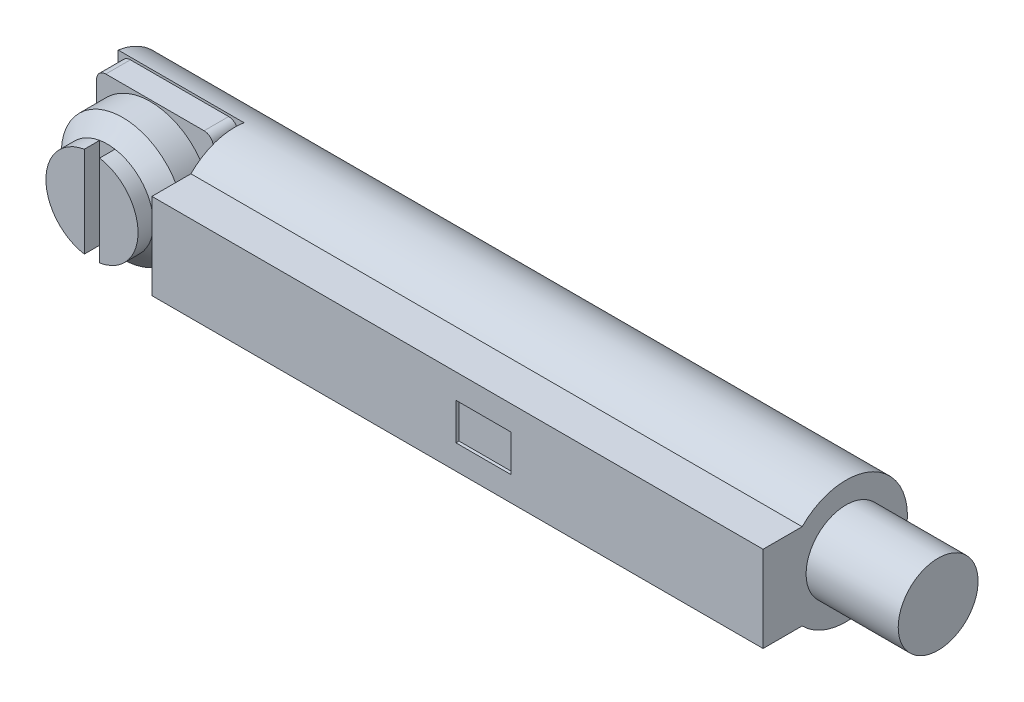
ISO-10303-21;
HEADER;
FILE_DESCRIPTION(('STEP AP214'),'2;1');
FILE_NAME('part.step','',(''),(''),'','','');
FILE_SCHEMA(('AUTOMOTIVE_DESIGN { 1 0 10303 214 1 1 1 1 }'));
ENDSEC;
DATA;
#1=APPLICATION_CONTEXT('core data for automotive mechanical design processes');
#2=APPLICATION_PROTOCOL_DEFINITION('international standard','automotive_design',2000,#1);
#3=PRODUCT_CONTEXT('',#1,'mechanical');
#4=PRODUCT('Part','Part','',(#3));
#5=PRODUCT_RELATED_PRODUCT_CATEGORY('part','',(#4));
#6=PRODUCT_DEFINITION_FORMATION('','',#4);
#7=PRODUCT_DEFINITION_CONTEXT('part definition',#1,'design');
#8=PRODUCT_DEFINITION('design','',#6,#7);
#9=PRODUCT_DEFINITION_SHAPE('','',#8);
#10=(LENGTH_UNIT() NAMED_UNIT(*) SI_UNIT(.MILLI.,.METRE.));
#11=(NAMED_UNIT(*) PLANE_ANGLE_UNIT() SI_UNIT($,.RADIAN.));
#12=(NAMED_UNIT(*) SI_UNIT($,.STERADIAN.) SOLID_ANGLE_UNIT());
#13=UNCERTAINTY_MEASURE_WITH_UNIT(LENGTH_MEASURE(1.E-05),#10,'distance_accuracy_value','');
#14=(GEOMETRIC_REPRESENTATION_CONTEXT(3) GLOBAL_UNCERTAINTY_ASSIGNED_CONTEXT((#13)) GLOBAL_UNIT_ASSIGNED_CONTEXT((#10,
#11,#12)) REPRESENTATION_CONTEXT('',''));
#15=CARTESIAN_POINT('',(0.,0.,0.));
#16=DIRECTION('',(0.,0.,1.));
#17=DIRECTION('',(1.,0.,0.));
#18=AXIS2_PLACEMENT_3D('',#15,#16,#17);
#19=CARTESIAN_POINT('',(24.,2.,0.));
#20=DIRECTION('',(1.,0.,0.));
#21=DIRECTION('',(0.,0.,-1.));
#22=AXIS2_PLACEMENT_3D('',#19,#20,#21);
#23=PLANE('',#22);
#24=DIRECTION('',(0.,-1.,0.));
#25=VECTOR('',#24,1.);
#26=CARTESIAN_POINT('',(24.,3.4,2.7));
#27=LINE('',#26,#25);
#28=CARTESIAN_POINT('',(24.,3.4,2.7));
#29=VERTEX_POINT('',#28);
#30=CARTESIAN_POINT('',(24.,0.6,2.7));
#31=VERTEX_POINT('',#30);
#32=EDGE_CURVE('E337',#29,#31,#27,.T.);
#33=ORIENTED_EDGE('',*,*,#32,.T.);
#34=DIRECTION('',(0.,0.,-1.));
#35=VECTOR('',#34,1.);
#36=CARTESIAN_POINT('',(24.,0.6,2.7));
#37=LINE('',#36,#35);
#38=CARTESIAN_POINT('',(24.,0.6,1.4282856857086));
#39=VERTEX_POINT('',#38);
#40=EDGE_CURVE('E340',#31,#39,#37,.T.);
#41=ORIENTED_EDGE('',*,*,#40,.T.);
#42=CARTESIAN_POINT('',(24.,2.,0.));
#43=DIRECTION('',(1.,0.,0.));
#44=DIRECTION('',(0.,0.,-1.));
#45=AXIS2_PLACEMENT_3D('',#42,#43,#44);
#46=CIRCLE('',#45,2.00000000000001);
#47=CARTESIAN_POINT('',(24.,3.4,1.4282856857086));
#48=VERTEX_POINT('',#47);
#49=EDGE_CURVE('E342',#39,#48,#46,.T.);
#50=ORIENTED_EDGE('',*,*,#49,.T.);
#51=DIRECTION('',(0.,0.,1.));
#52=VECTOR('',#51,1.);
#53=CARTESIAN_POINT('',(24.,3.4,1.4282856857086));
#54=LINE('',#53,#52);
#55=EDGE_CURVE('E344',#48,#29,#54,.T.);
#56=ORIENTED_EDGE('',*,*,#55,.T.);
#57=EDGE_LOOP('',(#33,#41,#50,#56));
#58=FACE_BOUND('',#57,.T.);
#59=CARTESIAN_POINT('',(24.,2.,0.));
#60=DIRECTION('',(-1.,0.,0.));
#61=DIRECTION('',(0.,0.,1.));
#62=AXIS2_PLACEMENT_3D('',#59,#60,#61);
#63=CIRCLE('',#62,1.3);
#64=CARTESIAN_POINT('',(24.,2.,1.3));
#65=VERTEX_POINT('',#64);
#66=EDGE_CURVE('E213',#65,#65,#63,.T.);
#67=ORIENTED_EDGE('',*,*,#66,.T.);
#68=EDGE_LOOP('',(#67));
#69=FACE_BOUND('',#68,.T.);
#70=ADVANCED_FACE('F37',(#58,#69),#23,.T.);
#71=CARTESIAN_POINT('',(2.,2.,2.55));
#72=DIRECTION('',(0.,0.,-1.));
#73=DIRECTION('',(-1.,0.,0.));
#74=AXIS2_PLACEMENT_3D('',#71,#72,#73);
#75=PLANE('',#74);
#76=DIRECTION('',(0.,-1.,0.));
#77=VECTOR('',#76,1.);
#78=CARTESIAN_POINT('',(1.75,4.,2.55));
#79=LINE('',#78,#77);
#80=CARTESIAN_POINT('',(1.75,3.4790199457749,2.55));
#81=VERTEX_POINT('',#80);
#82=CARTESIAN_POINT('',(1.75,0.520980054225101,2.55));
#83=VERTEX_POINT('',#82);
#84=EDGE_CURVE('E235',#81,#83,#79,.T.);
#85=ORIENTED_EDGE('',*,*,#84,.F.);
#86=CARTESIAN_POINT('',(2.,2.,2.55));
#87=DIRECTION('',(0.,0.,1.));
#88=DIRECTION('',(1.,0.,0.));
#89=AXIS2_PLACEMENT_3D('',#86,#87,#88);
#90=CIRCLE('',#89,1.49999999999999);
#91=EDGE_CURVE('E261',#81,#83,#90,.T.);
#92=ORIENTED_EDGE('',*,*,#91,.T.);
#93=EDGE_LOOP('',(#85,#92));
#94=FACE_BOUND('',#93,.T.);
#95=ADVANCED_FACE('F385',(#94),#75,.F.);
#96=DIRECTION('',(0.,-1.,0.));
#97=VECTOR('',#96,1.);
#98=CARTESIAN_POINT('',(2.25,4.,2.55));
#99=LINE('',#98,#97);
#100=CARTESIAN_POINT('',(2.25,3.4790199457749,2.55));
#101=VERTEX_POINT('',#100);
#102=CARTESIAN_POINT('',(2.25,0.520980054225101,2.55));
#103=VERTEX_POINT('',#102);
#104=EDGE_CURVE('E232',#101,#103,#99,.T.);
#105=ORIENTED_EDGE('',*,*,#104,.T.);
#106=EDGE_CURVE('E257',#103,#101,#90,.T.);
#107=ORIENTED_EDGE('',*,*,#106,.T.);
#108=EDGE_LOOP('',(#105,#107));
#109=FACE_BOUND('',#108,.T.);
#110=ADVANCED_FACE('F392',(#109),#75,.F.);
#111=CARTESIAN_POINT('',(2.,2.,0.3));
#112=DIRECTION('',(0.,0.,1.));
#113=DIRECTION('',(1.,0.,0.));
#114=AXIS2_PLACEMENT_3D('',#111,#112,#113);
#115=CYLINDRICAL_SURFACE('',#114,1.5);
#116=DIRECTION('',(0.,0.,1.));
#117=VECTOR('',#116,1.);
#118=CARTESIAN_POINT('',(1.75,3.4790199457749,0.3));
#119=LINE('',#118,#117);
#120=CARTESIAN_POINT('',(1.75,3.4790199457749,2.05));
#121=VERTEX_POINT('',#120);
#122=EDGE_CURVE('E243',#121,#81,#119,.T.);
#123=ORIENTED_EDGE('',*,*,#122,.F.);
#124=CARTESIAN_POINT('',(2.,2.,2.05));
#125=DIRECTION('',(0.,0.,1.));
#126=DIRECTION('',(1.,0.,0.));
#127=AXIS2_PLACEMENT_3D('',#124,#125,#126);
#128=CIRCLE('',#127,1.5);
#129=CARTESIAN_POINT('',(1.75,0.520980054225096,2.05));
#130=VERTEX_POINT('',#129);
#131=EDGE_CURVE('E258',#121,#130,#128,.T.);
#132=ORIENTED_EDGE('',*,*,#131,.T.);
#133=DIRECTION('',(0.,0.,1.));
#134=VECTOR('',#133,1.);
#135=CARTESIAN_POINT('',(1.75,0.520980054225101,0.3));
#136=LINE('',#135,#134);
#137=EDGE_CURVE('E241',#83,#130,#136,.F.);
#138=ORIENTED_EDGE('',*,*,#137,.F.);
#139=ORIENTED_EDGE('',*,*,#91,.F.);
#140=EDGE_LOOP('',(#123,#132,#138,#139));
#141=FACE_BOUND('',#140,.T.);
#142=ADVANCED_FACE('F442',(#141),#115,.T.);
#143=DIRECTION('',(0.,0.,1.));
#144=VECTOR('',#143,1.);
#145=CARTESIAN_POINT('',(2.25,0.520980054225101,0.3));
#146=LINE('',#145,#144);
#147=CARTESIAN_POINT('',(2.25,0.520980054225096,2.05));
#148=VERTEX_POINT('',#147);
#149=EDGE_CURVE('E239',#148,#103,#146,.T.);
#150=ORIENTED_EDGE('',*,*,#149,.F.);
#151=CARTESIAN_POINT('',(2.25,3.4790199457749,2.05));
#152=VERTEX_POINT('',#151);
#153=EDGE_CURVE('E254',#148,#152,#128,.T.);
#154=ORIENTED_EDGE('',*,*,#153,.T.);
#155=DIRECTION('',(0.,0.,1.));
#156=VECTOR('',#155,1.);
#157=CARTESIAN_POINT('',(2.25,3.4790199457749,0.3));
#158=LINE('',#157,#156);
#159=EDGE_CURVE('E237',#101,#152,#158,.F.);
#160=ORIENTED_EDGE('',*,*,#159,.F.);
#161=ORIENTED_EDGE('',*,*,#106,.F.);
#162=EDGE_LOOP('',(#150,#154,#160,#161));
#163=FACE_BOUND('',#162,.T.);
#164=ADVANCED_FACE('F439',(#163),#115,.T.);
#165=CARTESIAN_POINT('',(0.400000000000015,0.400000000000015,0.5));
#166=DIRECTION('',(0.,0.,1.));
#167=DIRECTION('',(1.,0.,0.));
#168=AXIS2_PLACEMENT_3D('',#165,#166,#167);
#169=PLANE('',#168);
#170=CARTESIAN_POINT('',(0.400000000000015,0.400000000000015,0.5));
#171=DIRECTION('',(0.,0.,1.));
#172=DIRECTION('',(1.,0.,0.));
#173=AXIS2_PLACEMENT_3D('',#170,#171,#172);
#174=CIRCLE('',#173,0.300000000000015);
#175=CARTESIAN_POINT('',(0.1,0.4,0.5));
#176=VERTEX_POINT('',#175);
#177=CARTESIAN_POINT('',(0.40000000000001,0.1,0.5));
#178=VERTEX_POINT('',#177);
#179=EDGE_CURVE('E262',#176,#178,#174,.T.);
#180=ORIENTED_EDGE('',*,*,#179,.T.);
#181=DIRECTION('',(1.,0.,0.));
#182=VECTOR('',#181,1.);
#183=CARTESIAN_POINT('',(0.40000000000001,0.1,0.5));
#184=LINE('',#183,#182);
#185=CARTESIAN_POINT('',(3.6,0.0999999999999999,0.5));
#186=VERTEX_POINT('',#185);
#187=EDGE_CURVE('E265',#178,#186,#184,.T.);
#188=ORIENTED_EDGE('',*,*,#187,.T.);
#189=CARTESIAN_POINT('',(3.60000000000007,0.399999999999929,0.5));
#190=DIRECTION('',(0.,0.,1.));
#191=DIRECTION('',(1.,0.,0.));
#192=AXIS2_PLACEMENT_3D('',#189,#190,#191);
#193=CIRCLE('',#192,0.29999999999993);
#194=CARTESIAN_POINT('',(3.9,0.4,0.5));
#195=VERTEX_POINT('',#194);
#196=EDGE_CURVE('E268',#186,#195,#193,.T.);
#197=ORIENTED_EDGE('',*,*,#196,.T.);
#198=DIRECTION('',(0.,1.,0.));
#199=VECTOR('',#198,1.);
#200=CARTESIAN_POINT('',(3.9,0.4,0.5));
#201=LINE('',#200,#199);
#202=CARTESIAN_POINT('',(3.9,3.6,0.5));
#203=VERTEX_POINT('',#202);
#204=EDGE_CURVE('E270',#195,#203,#201,.T.);
#205=ORIENTED_EDGE('',*,*,#204,.T.);
#206=CARTESIAN_POINT('',(3.60000000000012,3.60000000000012,0.5));
#207=DIRECTION('',(0.,0.,1.));
#208=DIRECTION('',(1.,0.,0.));
#209=AXIS2_PLACEMENT_3D('',#206,#207,#208);
#210=CIRCLE('',#209,0.299999999999878);
#211=CARTESIAN_POINT('',(3.6,3.9,0.5));
#212=VERTEX_POINT('',#211);
#213=EDGE_CURVE('E272',#203,#212,#210,.T.);
#214=ORIENTED_EDGE('',*,*,#213,.T.);
#215=DIRECTION('',(-1.,0.,0.));
#216=VECTOR('',#215,1.);
#217=CARTESIAN_POINT('',(3.6,3.9,0.5));
#218=LINE('',#217,#216);
#219=CARTESIAN_POINT('',(0.40000000000001,3.9,0.5));
#220=VERTEX_POINT('',#219);
#221=EDGE_CURVE('E274',#212,#220,#218,.T.);
#222=ORIENTED_EDGE('',*,*,#221,.T.);
#223=CARTESIAN_POINT('',(0.399999999999947,3.60000000000005,0.5));
#224=DIRECTION('',(0.,0.,1.));
#225=DIRECTION('',(1.,0.,0.));
#226=AXIS2_PLACEMENT_3D('',#223,#224,#225);
#227=CIRCLE('',#226,0.299999999999947);
#228=CARTESIAN_POINT('',(0.1,3.6,0.5));
#229=VERTEX_POINT('',#228);
#230=EDGE_CURVE('E276',#220,#229,#227,.T.);
#231=ORIENTED_EDGE('',*,*,#230,.T.);
#232=DIRECTION('',(0.,-1.,0.));
#233=VECTOR('',#232,1.);
#234=CARTESIAN_POINT('',(0.1,3.6,0.5));
#235=LINE('',#234,#233);
#236=EDGE_CURVE('E278',#229,#176,#235,.T.);
#237=ORIENTED_EDGE('',*,*,#236,.T.);
#238=EDGE_LOOP('',(#180,#188,#197,#205,#214,#222,#231,#237));
#239=FACE_BOUND('',#238,.T.);
#240=CARTESIAN_POINT('',(2.,2.,0.5));
#241=DIRECTION('',(0.,0.,1.));
#242=DIRECTION('',(1.,0.,0.));
#243=AXIS2_PLACEMENT_3D('',#240,#241,#242);
#244=CIRCLE('',#243,0.75);
#245=CARTESIAN_POINT('',(2.75,2.,0.5));
#246=VERTEX_POINT('',#245);
#247=EDGE_CURVE('E41',#246,#246,#244,.F.);
#248=ORIENTED_EDGE('',*,*,#247,.T.);
#249=EDGE_LOOP('',(#248));
#250=FACE_BOUND('',#249,.T.);
#251=ADVANCED_FACE('F399',(#239,#250),#169,.T.);
#252=CARTESIAN_POINT('',(4.1,0.,-0.3));
#253=DIRECTION('',(0.,0.,1.));
#254=DIRECTION('',(1.,0.,0.));
#255=AXIS2_PLACEMENT_3D('',#252,#253,#254);
#256=PLANE('',#255);
#257=DIRECTION('',(-1.,0.,0.));
#258=VECTOR('',#257,1.);
#259=CARTESIAN_POINT('',(24.,3.97737199332853,-0.3));
#260=LINE('',#259,#258);
#261=CARTESIAN_POINT('',(4.1,3.97737199332853,-0.3));
#262=VERTEX_POINT('',#261);
#263=CARTESIAN_POINT('',(0.,3.97737199332853,-0.3));
#264=VERTEX_POINT('',#263);
#265=EDGE_CURVE('E328',#262,#264,#260,.T.);
#266=ORIENTED_EDGE('',*,*,#265,.T.);
#267=DIRECTION('',(0.,-1.,0.));
#268=VECTOR('',#267,1.);
#269=CARTESIAN_POINT('',(0.,2.,-0.3));
#270=LINE('',#269,#268);
#271=CARTESIAN_POINT('',(0.,0.0226280066714709,-0.3));
#272=VERTEX_POINT('',#271);
#273=EDGE_CURVE('E46',#264,#272,#270,.T.);
#274=ORIENTED_EDGE('',*,*,#273,.T.);
#275=DIRECTION('',(-1.,0.,0.));
#276=VECTOR('',#275,1.);
#277=CARTESIAN_POINT('',(24.,0.0226280066714709,-0.3));
#278=LINE('',#277,#276);
#279=CARTESIAN_POINT('',(4.1,0.0226280066714709,-0.3));
#280=VERTEX_POINT('',#279);
#281=EDGE_CURVE('E325',#272,#280,#278,.F.);
#282=ORIENTED_EDGE('',*,*,#281,.T.);
#283=DIRECTION('',(0.,1.,0.));
#284=VECTOR('',#283,1.);
#285=CARTESIAN_POINT('',(4.1,0.,-0.3));
#286=LINE('',#285,#284);
#287=EDGE_CURVE('E322',#280,#262,#286,.T.);
#288=ORIENTED_EDGE('',*,*,#287,.T.);
#289=EDGE_LOOP('',(#266,#274,#282,#288));
#290=FACE_BOUND('',#289,.T.);
#291=DIRECTION('',(1.,0.,0.));
#292=VECTOR('',#291,1.);
#293=CARTESIAN_POINT('',(0.40000000000001,0.1,-0.3));
#294=LINE('',#293,#292);
#295=CARTESIAN_POINT('',(0.40000000000001,0.1,-0.3));
#296=VERTEX_POINT('',#295);
#297=CARTESIAN_POINT('',(3.6,0.0999999999999999,-0.3));
#298=VERTEX_POINT('',#297);
#299=EDGE_CURVE('E284',#296,#298,#294,.T.);
#300=ORIENTED_EDGE('',*,*,#299,.F.);
#301=CARTESIAN_POINT('',(0.400000000000015,0.400000000000015,-0.3));
#302=DIRECTION('',(0.,0.,1.));
#303=DIRECTION('',(1.,0.,0.));
#304=AXIS2_PLACEMENT_3D('',#301,#302,#303);
#305=CIRCLE('',#304,0.300000000000015);
#306=CARTESIAN_POINT('',(0.1,0.4,-0.3));
#307=VERTEX_POINT('',#306);
#308=EDGE_CURVE('E281',#307,#296,#305,.T.);
#309=ORIENTED_EDGE('',*,*,#308,.F.);
#310=DIRECTION('',(0.,-1.,0.));
#311=VECTOR('',#310,1.);
#312=CARTESIAN_POINT('',(0.1,3.6,-0.3));
#313=LINE('',#312,#311);
#314=CARTESIAN_POINT('',(0.1,3.6,-0.3));
#315=VERTEX_POINT('',#314);
#316=EDGE_CURVE('E266',#315,#307,#313,.T.);
#317=ORIENTED_EDGE('',*,*,#316,.F.);
#318=CARTESIAN_POINT('',(0.399999999999947,3.60000000000005,-0.3));
#319=DIRECTION('',(0.,0.,1.));
#320=DIRECTION('',(1.,0.,0.));
#321=AXIS2_PLACEMENT_3D('',#318,#319,#320);
#322=CIRCLE('',#321,0.299999999999947);
#323=CARTESIAN_POINT('',(0.40000000000001,3.9,-0.3));
#324=VERTEX_POINT('',#323);
#325=EDGE_CURVE('E294',#324,#315,#322,.T.);
#326=ORIENTED_EDGE('',*,*,#325,.F.);
#327=DIRECTION('',(-1.,0.,0.));
#328=VECTOR('',#327,1.);
#329=CARTESIAN_POINT('',(3.6,3.9,-0.3));
#330=LINE('',#329,#328);
#331=CARTESIAN_POINT('',(3.6,3.9,-0.3));
#332=VERTEX_POINT('',#331);
#333=EDGE_CURVE('E292',#332,#324,#330,.T.);
#334=ORIENTED_EDGE('',*,*,#333,.F.);
#335=CARTESIAN_POINT('',(3.60000000000012,3.60000000000012,-0.3));
#336=DIRECTION('',(0.,0.,1.));
#337=DIRECTION('',(1.,0.,0.));
#338=AXIS2_PLACEMENT_3D('',#335,#336,#337);
#339=CIRCLE('',#338,0.299999999999878);
#340=CARTESIAN_POINT('',(3.9,3.6,-0.3));
#341=VERTEX_POINT('',#340);
#342=EDGE_CURVE('E290',#341,#332,#339,.T.);
#343=ORIENTED_EDGE('',*,*,#342,.F.);
#344=DIRECTION('',(0.,1.,0.));
#345=VECTOR('',#344,1.);
#346=CARTESIAN_POINT('',(3.9,0.4,-0.3));
#347=LINE('',#346,#345);
#348=CARTESIAN_POINT('',(3.9,0.4,-0.3));
#349=VERTEX_POINT('',#348);
#350=EDGE_CURVE('E288',#349,#341,#347,.T.);
#351=ORIENTED_EDGE('',*,*,#350,.F.);
#352=CARTESIAN_POINT('',(3.60000000000007,0.399999999999929,-0.3));
#353=DIRECTION('',(0.,0.,1.));
#354=DIRECTION('',(1.,0.,0.));
#355=AXIS2_PLACEMENT_3D('',#352,#353,#354);
#356=CIRCLE('',#355,0.29999999999993);
#357=EDGE_CURVE('E286',#298,#349,#356,.T.);
#358=ORIENTED_EDGE('',*,*,#357,.F.);
#359=EDGE_LOOP('',(#300,#309,#317,#326,#334,#343,#351,#358));
#360=FACE_BOUND('',#359,.T.);
#361=ADVANCED_FACE('F363',(#290,#360),#256,.T.);
#362=CARTESIAN_POINT('',(24.,2.,0.));
#363=DIRECTION('',(-1.,0.,0.));
#364=DIRECTION('',(0.,0.,1.));
#365=AXIS2_PLACEMENT_3D('',#362,#363,#364);
#366=CYLINDRICAL_SURFACE('',#365,2.00000000000001);
#367=ORIENTED_EDGE('',*,*,#265,.F.);
#368=CARTESIAN_POINT('',(4.1,2.,0.));
#369=DIRECTION('',(1.,0.,0.));
#370=DIRECTION('',(0.,0.,-1.));
#371=AXIS2_PLACEMENT_3D('',#368,#369,#370);
#372=CIRCLE('',#371,2.00000000000001);
#373=CARTESIAN_POINT('',(4.1,3.4,1.4282856857086));
#374=VERTEX_POINT('',#373);
#375=EDGE_CURVE('E330',#262,#374,#372,.T.);
#376=ORIENTED_EDGE('',*,*,#375,.T.);
#377=DIRECTION('',(-1.,0.,0.));
#378=VECTOR('',#377,1.);
#379=CARTESIAN_POINT('',(24.,3.4,1.4282856857086));
#380=LINE('',#379,#378);
#381=EDGE_CURVE('E351',#48,#374,#380,.T.);
#382=ORIENTED_EDGE('',*,*,#381,.F.);
#383=ORIENTED_EDGE('',*,*,#49,.F.);
#384=DIRECTION('',(-1.,0.,0.));
#385=VECTOR('',#384,1.);
#386=CARTESIAN_POINT('',(24.,0.6,1.4282856857086));
#387=LINE('',#386,#385);
#388=CARTESIAN_POINT('',(4.1,0.6,1.4282856857086));
#389=VERTEX_POINT('',#388);
#390=EDGE_CURVE('E354',#39,#389,#387,.T.);
#391=ORIENTED_EDGE('',*,*,#390,.T.);
#392=EDGE_CURVE('E331',#389,#280,#372,.T.);
#393=ORIENTED_EDGE('',*,*,#392,.T.);
#394=ORIENTED_EDGE('',*,*,#281,.F.);
#395=CARTESIAN_POINT('',(0.,2.,0.));
#396=DIRECTION('',(1.,0.,0.));
#397=DIRECTION('',(0.,0.,-1.));
#398=AXIS2_PLACEMENT_3D('',#395,#396,#397);
#399=CIRCLE('',#398,2.00000000000001);
#400=EDGE_CURVE('E336',#272,#264,#399,.T.);
#401=ORIENTED_EDGE('',*,*,#400,.T.);
#402=EDGE_LOOP('',(#367,#376,#382,#383,#391,#393,#394,#401));
#403=FACE_BOUND('',#402,.T.);
#404=ADVANCED_FACE('F370',(#403),#366,.T.);
#405=CARTESIAN_POINT('',(0.,2.,0.));
#406=DIRECTION('',(1.,0.,0.));
#407=DIRECTION('',(0.,0.,-1.));
#408=AXIS2_PLACEMENT_3D('',#405,#406,#407);
#409=PLANE('',#408);
#410=ORIENTED_EDGE('',*,*,#273,.F.);
#411=ORIENTED_EDGE('',*,*,#400,.F.);
#412=EDGE_LOOP('',(#410,#411));
#413=FACE_BOUND('',#412,.T.);
#414=ADVANCED_FACE('F371',(#413),#409,.F.);
#415=CARTESIAN_POINT('',(24.,3.4,2.7));
#416=DIRECTION('',(0.,0.,-1.));
#417=DIRECTION('',(-1.,0.,0.));
#418=AXIS2_PLACEMENT_3D('',#415,#416,#417);
#419=PLANE('',#418);
#420=DIRECTION('',(1.,0.,0.));
#421=VECTOR('',#420,1.);
#422=CARTESIAN_POINT('',(14.,1.4,2.7));
#423=LINE('',#422,#421);
#424=CARTESIAN_POINT('',(14.,1.4,2.7));
#425=VERTEX_POINT('',#424);
#426=CARTESIAN_POINT('',(15.8,1.4,2.7));
#427=VERTEX_POINT('',#426);
#428=EDGE_CURVE('E219',#425,#427,#423,.T.);
#429=ORIENTED_EDGE('',*,*,#428,.F.);
#430=DIRECTION('',(0.,-1.,0.));
#431=VECTOR('',#430,1.);
#432=CARTESIAN_POINT('',(14.,2.6,2.7));
#433=LINE('',#432,#431);
#434=CARTESIAN_POINT('',(14.,2.6,2.7));
#435=VERTEX_POINT('',#434);
#436=EDGE_CURVE('E53',#435,#425,#433,.T.);
#437=ORIENTED_EDGE('',*,*,#436,.F.);
#438=DIRECTION('',(-1.,0.,0.));
#439=VECTOR('',#438,1.);
#440=CARTESIAN_POINT('',(15.8,2.6,2.7));
#441=LINE('',#440,#439);
#442=CARTESIAN_POINT('',(15.8,2.6,2.7));
#443=VERTEX_POINT('',#442);
#444=EDGE_CURVE('E207',#443,#435,#441,.T.);
#445=ORIENTED_EDGE('',*,*,#444,.F.);
#446=DIRECTION('',(0.,1.,0.));
#447=VECTOR('',#446,1.);
#448=CARTESIAN_POINT('',(15.8,1.4,2.7));
#449=LINE('',#448,#447);
#450=EDGE_CURVE('E210',#427,#443,#449,.T.);
#451=ORIENTED_EDGE('',*,*,#450,.F.);
#452=EDGE_LOOP('',(#429,#437,#445,#451));
#453=FACE_BOUND('',#452,.T.);
#454=DIRECTION('',(-1.,0.,0.));
#455=VECTOR('',#454,1.);
#456=CARTESIAN_POINT('',(24.,3.4,2.7));
#457=LINE('',#456,#455);
#458=CARTESIAN_POINT('',(4.1,3.4,2.7));
#459=VERTEX_POINT('',#458);
#460=EDGE_CURVE('E346',#29,#459,#457,.T.);
#461=ORIENTED_EDGE('',*,*,#460,.T.);
#462=DIRECTION('',(0.,-1.,0.));
#463=VECTOR('',#462,1.);
#464=CARTESIAN_POINT('',(4.1,4.,2.7));
#465=LINE('',#464,#463);
#466=CARTESIAN_POINT('',(4.1,0.6,2.7));
#467=VERTEX_POINT('',#466);
#468=EDGE_CURVE('E319',#459,#467,#465,.T.);
#469=ORIENTED_EDGE('',*,*,#468,.T.);
#470=DIRECTION('',(-1.,0.,0.));
#471=VECTOR('',#470,1.);
#472=CARTESIAN_POINT('',(24.,0.6,2.7));
#473=LINE('',#472,#471);
#474=EDGE_CURVE('E357',#31,#467,#473,.T.);
#475=ORIENTED_EDGE('',*,*,#474,.F.);
#476=ORIENTED_EDGE('',*,*,#32,.F.);
#477=EDGE_LOOP('',(#461,#469,#475,#476));
#478=FACE_BOUND('',#477,.T.);
#479=ADVANCED_FACE('F39',(#453,#478),#419,.F.);
#480=CARTESIAN_POINT('',(24.,0.6,2.7));
#481=DIRECTION('',(0.,1.,0.));
#482=DIRECTION('',(0.,0.,1.));
#483=AXIS2_PLACEMENT_3D('',#480,#481,#482);
#484=PLANE('',#483);
#485=ORIENTED_EDGE('',*,*,#474,.T.);
#486=DIRECTION('',(0.,0.,-1.));
#487=VECTOR('',#486,1.);
#488=CARTESIAN_POINT('',(4.1,0.6,2.7));
#489=LINE('',#488,#487);
#490=EDGE_CURVE('E333',#467,#389,#489,.T.);
#491=ORIENTED_EDGE('',*,*,#490,.T.);
#492=ORIENTED_EDGE('',*,*,#390,.F.);
#493=ORIENTED_EDGE('',*,*,#40,.F.);
#494=EDGE_LOOP('',(#485,#491,#492,#493));
#495=FACE_BOUND('',#494,.T.);
#496=ADVANCED_FACE('F379',(#495),#484,.F.);
#497=CARTESIAN_POINT('',(24.,3.4,1.4282856857086));
#498=DIRECTION('',(0.,-1.,0.));
#499=DIRECTION('',(0.,0.,-1.));
#500=AXIS2_PLACEMENT_3D('',#497,#498,#499);
#501=PLANE('',#500);
#502=ORIENTED_EDGE('',*,*,#381,.T.);
#503=DIRECTION('',(0.,0.,1.));
#504=VECTOR('',#503,1.);
#505=CARTESIAN_POINT('',(4.1,3.4,1.4282856857086));
#506=LINE('',#505,#504);
#507=EDGE_CURVE('E11',#374,#459,#506,.T.);
#508=ORIENTED_EDGE('',*,*,#507,.T.);
#509=ORIENTED_EDGE('',*,*,#460,.F.);
#510=ORIENTED_EDGE('',*,*,#55,.F.);
#511=EDGE_LOOP('',(#502,#508,#509,#510));
#512=FACE_BOUND('',#511,.T.);
#513=ADVANCED_FACE('F404',(#512),#501,.F.);
#514=CARTESIAN_POINT('',(4.1,0.,2.7));
#515=DIRECTION('',(1.,0.,0.));
#516=DIRECTION('',(0.,0.,-1.));
#517=AXIS2_PLACEMENT_3D('',#514,#515,#516);
#518=PLANE('',#517);
#519=ORIENTED_EDGE('',*,*,#468,.F.);
#520=ORIENTED_EDGE('',*,*,#507,.F.);
#521=ORIENTED_EDGE('',*,*,#375,.F.);
#522=ORIENTED_EDGE('',*,*,#287,.F.);
#523=ORIENTED_EDGE('',*,*,#392,.F.);
#524=ORIENTED_EDGE('',*,*,#490,.F.);
#525=EDGE_LOOP('',(#519,#520,#521,#522,#523,#524));
#526=FACE_BOUND('',#525,.T.);
#527=ADVANCED_FACE('F400',(#526),#518,.F.);
#528=CARTESIAN_POINT('',(0.400000000000015,0.400000000000015,0.5));
#529=DIRECTION('',(0.,0.,-1.));
#530=DIRECTION('',(-1.,0.,0.));
#531=AXIS2_PLACEMENT_3D('',#528,#529,#530);
#532=CYLINDRICAL_SURFACE('',#531,0.300000000000015);
#533=ORIENTED_EDGE('',*,*,#308,.T.);
#534=DIRECTION('',(0.,0.,-1.));
#535=VECTOR('',#534,1.);
#536=CARTESIAN_POINT('',(0.40000000000001,0.1,0.5));
#537=LINE('',#536,#535);
#538=EDGE_CURVE('E317',#178,#296,#537,.T.);
#539=ORIENTED_EDGE('',*,*,#538,.F.);
#540=ORIENTED_EDGE('',*,*,#179,.F.);
#541=DIRECTION('',(0.,0.,-1.));
#542=VECTOR('',#541,1.);
#543=CARTESIAN_POINT('',(0.1,0.4,0.5));
#544=LINE('',#543,#542);
#545=EDGE_CURVE('E280',#176,#307,#544,.T.);
#546=ORIENTED_EDGE('',*,*,#545,.T.);
#547=EDGE_LOOP('',(#533,#539,#540,#546));
#548=FACE_BOUND('',#547,.T.);
#549=ADVANCED_FACE('F403',(#548),#532,.T.);
#550=CARTESIAN_POINT('',(0.40000000000001,0.1,0.5));
#551=DIRECTION('',(0.,1.,0.));
#552=DIRECTION('',(0.,0.,1.));
#553=AXIS2_PLACEMENT_3D('',#550,#551,#552);
#554=PLANE('',#553);
#555=ORIENTED_EDGE('',*,*,#299,.T.);
#556=DIRECTION('',(0.,0.,-1.));
#557=VECTOR('',#556,1.);
#558=CARTESIAN_POINT('',(3.6,0.0999999999999999,0.5));
#559=LINE('',#558,#557);
#560=EDGE_CURVE('E314',#186,#298,#559,.T.);
#561=ORIENTED_EDGE('',*,*,#560,.F.);
#562=ORIENTED_EDGE('',*,*,#187,.F.);
#563=ORIENTED_EDGE('',*,*,#538,.T.);
#564=EDGE_LOOP('',(#555,#561,#562,#563));
#565=FACE_BOUND('',#564,.T.);
#566=ADVANCED_FACE('F408',(#565),#554,.F.);
#567=CARTESIAN_POINT('',(3.60000000000007,0.399999999999929,0.5));
#568=DIRECTION('',(0.,0.,-1.));
#569=DIRECTION('',(-1.,0.,0.));
#570=AXIS2_PLACEMENT_3D('',#567,#568,#569);
#571=CYLINDRICAL_SURFACE('',#570,0.29999999999993);
#572=ORIENTED_EDGE('',*,*,#357,.T.);
#573=DIRECTION('',(0.,0.,-1.));
#574=VECTOR('',#573,1.);
#575=CARTESIAN_POINT('',(3.9,0.4,0.5));
#576=LINE('',#575,#574);
#577=EDGE_CURVE('E311',#195,#349,#576,.T.);
#578=ORIENTED_EDGE('',*,*,#577,.F.);
#579=ORIENTED_EDGE('',*,*,#196,.F.);
#580=ORIENTED_EDGE('',*,*,#560,.T.);
#581=EDGE_LOOP('',(#572,#578,#579,#580));
#582=FACE_BOUND('',#581,.T.);
#583=ADVANCED_FACE('F412',(#582),#571,.T.);
#584=CARTESIAN_POINT('',(3.9,0.4,0.5));
#585=DIRECTION('',(-1.,0.,0.));
#586=DIRECTION('',(0.,0.,1.));
#587=AXIS2_PLACEMENT_3D('',#584,#585,#586);
#588=PLANE('',#587);
#589=ORIENTED_EDGE('',*,*,#350,.T.);
#590=DIRECTION('',(0.,0.,-1.));
#591=VECTOR('',#590,1.);
#592=CARTESIAN_POINT('',(3.9,3.6,0.5));
#593=LINE('',#592,#591);
#594=EDGE_CURVE('E308',#203,#341,#593,.T.);
#595=ORIENTED_EDGE('',*,*,#594,.F.);
#596=ORIENTED_EDGE('',*,*,#204,.F.);
#597=ORIENTED_EDGE('',*,*,#577,.T.);
#598=EDGE_LOOP('',(#589,#595,#596,#597));
#599=FACE_BOUND('',#598,.T.);
#600=ADVANCED_FACE('F416',(#599),#588,.F.);
#601=CARTESIAN_POINT('',(3.60000000000012,3.60000000000012,0.5));
#602=DIRECTION('',(0.,0.,-1.));
#603=DIRECTION('',(-1.,0.,0.));
#604=AXIS2_PLACEMENT_3D('',#601,#602,#603);
#605=CYLINDRICAL_SURFACE('',#604,0.299999999999878);
#606=ORIENTED_EDGE('',*,*,#342,.T.);
#607=DIRECTION('',(0.,0.,-1.));
#608=VECTOR('',#607,1.);
#609=CARTESIAN_POINT('',(3.6,3.9,0.5));
#610=LINE('',#609,#608);
#611=EDGE_CURVE('E305',#212,#332,#610,.T.);
#612=ORIENTED_EDGE('',*,*,#611,.F.);
#613=ORIENTED_EDGE('',*,*,#213,.F.);
#614=ORIENTED_EDGE('',*,*,#594,.T.);
#615=EDGE_LOOP('',(#606,#612,#613,#614));
#616=FACE_BOUND('',#615,.T.);
#617=ADVANCED_FACE('F420',(#616),#605,.T.);
#618=CARTESIAN_POINT('',(3.6,3.9,0.5));
#619=DIRECTION('',(0.,-1.,0.));
#620=DIRECTION('',(0.,0.,-1.));
#621=AXIS2_PLACEMENT_3D('',#618,#619,#620);
#622=PLANE('',#621);
#623=ORIENTED_EDGE('',*,*,#333,.T.);
#624=DIRECTION('',(0.,0.,-1.));
#625=VECTOR('',#624,1.);
#626=CARTESIAN_POINT('',(0.40000000000001,3.9,0.5));
#627=LINE('',#626,#625);
#628=EDGE_CURVE('E302',#220,#324,#627,.T.);
#629=ORIENTED_EDGE('',*,*,#628,.F.);
#630=ORIENTED_EDGE('',*,*,#221,.F.);
#631=ORIENTED_EDGE('',*,*,#611,.T.);
#632=EDGE_LOOP('',(#623,#629,#630,#631));
#633=FACE_BOUND('',#632,.T.);
#634=ADVANCED_FACE('F424',(#633),#622,.F.);
#635=CARTESIAN_POINT('',(0.399999999999947,3.60000000000005,0.5));
#636=DIRECTION('',(0.,0.,-1.));
#637=DIRECTION('',(-1.,0.,0.));
#638=AXIS2_PLACEMENT_3D('',#635,#636,#637);
#639=CYLINDRICAL_SURFACE('',#638,0.299999999999947);
#640=ORIENTED_EDGE('',*,*,#325,.T.);
#641=DIRECTION('',(0.,0.,-1.));
#642=VECTOR('',#641,1.);
#643=CARTESIAN_POINT('',(0.1,3.6,0.5));
#644=LINE('',#643,#642);
#645=EDGE_CURVE('E300',#229,#315,#644,.T.);
#646=ORIENTED_EDGE('',*,*,#645,.F.);
#647=ORIENTED_EDGE('',*,*,#230,.F.);
#648=ORIENTED_EDGE('',*,*,#628,.T.);
#649=EDGE_LOOP('',(#640,#646,#647,#648));
#650=FACE_BOUND('',#649,.T.);
#651=ADVANCED_FACE('F428',(#650),#639,.T.);
#652=CARTESIAN_POINT('',(0.1,3.6,0.5));
#653=DIRECTION('',(1.,0.,0.));
#654=DIRECTION('',(0.,0.,-1.));
#655=AXIS2_PLACEMENT_3D('',#652,#653,#654);
#656=PLANE('',#655);
#657=ORIENTED_EDGE('',*,*,#316,.T.);
#658=ORIENTED_EDGE('',*,*,#545,.F.);
#659=ORIENTED_EDGE('',*,*,#236,.F.);
#660=ORIENTED_EDGE('',*,*,#645,.T.);
#661=EDGE_LOOP('',(#657,#658,#659,#660));
#662=FACE_BOUND('',#661,.T.);
#663=ADVANCED_FACE('F432',(#662),#656,.F.);
#664=CARTESIAN_POINT('',(2.,2.,1.55));
#665=DIRECTION('',(0.,0.,-1.));
#666=DIRECTION('',(-1.,0.,0.));
#667=AXIS2_PLACEMENT_3D('',#664,#665,#666);
#668=CONICAL_SURFACE('',#667,2.,0.785398163397448);
#669=EDGE_CURVE('E255',#152,#121,#128,.T.);
#670=ORIENTED_EDGE('',*,*,#669,.F.);
#671=ORIENTED_EDGE('',*,*,#153,.F.);
#672=EDGE_CURVE('E658',#130,#148,#128,.T.);
#673=ORIENTED_EDGE('',*,*,#672,.F.);
#674=ORIENTED_EDGE('',*,*,#131,.F.);
#675=EDGE_LOOP('',(#670,#671,#673,#674));
#676=FACE_BOUND('',#675,.T.);
#677=CARTESIAN_POINT('',(2.,2.,1.55));
#678=DIRECTION('',(0.,0.,1.));
#679=DIRECTION('',(1.,0.,0.));
#680=AXIS2_PLACEMENT_3D('',#677,#678,#679);
#681=CIRCLE('',#680,2.);
#682=CARTESIAN_POINT('',(4.,2.,1.55));
#683=VERTEX_POINT('',#682);
#684=EDGE_CURVE('E251',#683,#683,#681,.T.);
#685=ORIENTED_EDGE('',*,*,#684,.T.);
#686=EDGE_LOOP('',(#685));
#687=FACE_BOUND('',#686,.T.);
#688=ADVANCED_FACE('F436',(#676,#687),#668,.T.);
#689=CARTESIAN_POINT('',(2.,2.,0.3));
#690=DIRECTION('',(0.,0.,1.));
#691=DIRECTION('',(1.,0.,0.));
#692=AXIS2_PLACEMENT_3D('',#689,#690,#691);
#693=CYLINDRICAL_SURFACE('',#692,2.);
#694=ORIENTED_EDGE('',*,*,#684,.F.);
#695=EDGE_LOOP('',(#694));
#696=FACE_BOUND('',#695,.T.);
#697=CARTESIAN_POINT('',(2.,2.,0.65));
#698=DIRECTION('',(0.,0.,1.));
#699=DIRECTION('',(1.,0.,0.));
#700=AXIS2_PLACEMENT_3D('',#697,#698,#699);
#701=CIRCLE('',#700,2.);
#702=CARTESIAN_POINT('',(4.,2.,0.65));
#703=VERTEX_POINT('',#702);
#704=EDGE_CURVE('E248',#703,#703,#701,.T.);
#705=ORIENTED_EDGE('',*,*,#704,.T.);
#706=EDGE_LOOP('',(#705));
#707=FACE_BOUND('',#706,.T.);
#708=ADVANCED_FACE('F448',(#696,#707),#693,.T.);
#709=CARTESIAN_POINT('',(0.,2.,0.65));
#710=DIRECTION('',(0.,0.,1.));
#711=DIRECTION('',(1.,0.,0.));
#712=AXIS2_PLACEMENT_3D('',#709,#710,#711);
#713=PLANE('',#712);
#714=ORIENTED_EDGE('',*,*,#704,.F.);
#715=EDGE_LOOP('',(#714));
#716=FACE_BOUND('',#715,.T.);
#717=CARTESIAN_POINT('',(2.,2.,0.65));
#718=DIRECTION('',(0.,0.,1.));
#719=DIRECTION('',(1.,0.,0.));
#720=AXIS2_PLACEMENT_3D('',#717,#718,#719);
#721=CIRCLE('',#720,0.75);
#722=CARTESIAN_POINT('',(2.75,2.,0.65));
#723=VERTEX_POINT('',#722);
#724=EDGE_CURVE('E245',#723,#723,#721,.T.);
#725=ORIENTED_EDGE('',*,*,#724,.T.);
#726=EDGE_LOOP('',(#725));
#727=FACE_BOUND('',#726,.T.);
#728=ADVANCED_FACE('F452',(#716,#727),#713,.F.);
#729=CARTESIAN_POINT('',(2.,2.,0.3));
#730=DIRECTION('',(0.,0.,1.));
#731=DIRECTION('',(1.,0.,0.));
#732=AXIS2_PLACEMENT_3D('',#729,#730,#731);
#733=CYLINDRICAL_SURFACE('',#732,0.75);
#734=ORIENTED_EDGE('',*,*,#247,.F.);
#735=EDGE_LOOP('',(#734));
#736=FACE_BOUND('',#735,.T.);
#737=ORIENTED_EDGE('',*,*,#724,.F.);
#738=EDGE_LOOP('',(#737));
#739=FACE_BOUND('',#738,.T.);
#740=ADVANCED_FACE('F456',(#736,#739),#733,.T.);
#741=CARTESIAN_POINT('',(1.75,4.,2.05));
#742=DIRECTION('',(1.,0.,0.));
#743=DIRECTION('',(0.,0.,-1.));
#744=AXIS2_PLACEMENT_3D('',#741,#742,#743);
#745=PLANE('',#744);
#746=ORIENTED_EDGE('',*,*,#122,.T.);
#747=ORIENTED_EDGE('',*,*,#84,.T.);
#748=ORIENTED_EDGE('',*,*,#137,.T.);
#749=DIRECTION('',(0.,-1.,0.));
#750=VECTOR('',#749,1.);
#751=CARTESIAN_POINT('',(1.75,4.,2.05));
#752=LINE('',#751,#750);
#753=EDGE_CURVE('E61',#121,#130,#752,.T.);
#754=ORIENTED_EDGE('',*,*,#753,.F.);
#755=EDGE_LOOP('',(#746,#747,#748,#754));
#756=FACE_BOUND('',#755,.T.);
#757=ADVANCED_FACE('F460',(#756),#745,.T.);
#758=CARTESIAN_POINT('',(2.25,4.,2.55));
#759=DIRECTION('',(-1.,0.,0.));
#760=DIRECTION('',(0.,0.,1.));
#761=AXIS2_PLACEMENT_3D('',#758,#759,#760);
#762=PLANE('',#761);
#763=ORIENTED_EDGE('',*,*,#149,.T.);
#764=ORIENTED_EDGE('',*,*,#104,.F.);
#765=ORIENTED_EDGE('',*,*,#159,.T.);
#766=DIRECTION('',(0.,-1.,0.));
#767=VECTOR('',#766,1.);
#768=CARTESIAN_POINT('',(2.25,4.,2.05));
#769=LINE('',#768,#767);
#770=EDGE_CURVE('E229',#152,#148,#769,.T.);
#771=ORIENTED_EDGE('',*,*,#770,.T.);
#772=EDGE_LOOP('',(#763,#764,#765,#771));
#773=FACE_BOUND('',#772,.T.);
#774=ADVANCED_FACE('F464',(#773),#762,.T.);
#775=CARTESIAN_POINT('',(2.25,4.,2.05));
#776=DIRECTION('',(0.,0.,1.));
#777=DIRECTION('',(1.,0.,0.));
#778=AXIS2_PLACEMENT_3D('',#775,#776,#777);
#779=PLANE('',#778);
#780=ORIENTED_EDGE('',*,*,#669,.T.);
#781=ORIENTED_EDGE('',*,*,#753,.T.);
#782=ORIENTED_EDGE('',*,*,#672,.T.);
#783=ORIENTED_EDGE('',*,*,#770,.F.);
#784=EDGE_LOOP('',(#780,#781,#782,#783));
#785=FACE_BOUND('',#784,.T.);
#786=ADVANCED_FACE('F468',(#785),#779,.T.);
#787=CARTESIAN_POINT('',(14.,2.6,2.6));
#788=DIRECTION('',(-1.,0.,0.));
#789=DIRECTION('',(0.,0.,1.));
#790=AXIS2_PLACEMENT_3D('',#787,#788,#789);
#791=PLANE('',#790);
#792=ORIENTED_EDGE('',*,*,#436,.T.);
#793=DIRECTION('',(0.,0.,1.));
#794=VECTOR('',#793,1.);
#795=CARTESIAN_POINT('',(14.,1.4,2.6));
#796=LINE('',#795,#794);
#797=CARTESIAN_POINT('',(14.,1.4,2.6));
#798=VERTEX_POINT('',#797);
#799=EDGE_CURVE('E185',#798,#425,#796,.T.);
#800=ORIENTED_EDGE('',*,*,#799,.F.);
#801=DIRECTION('',(0.,-1.,0.));
#802=VECTOR('',#801,1.);
#803=CARTESIAN_POINT('',(14.,2.6,2.6));
#804=LINE('',#803,#802);
#805=CARTESIAN_POINT('',(14.,2.6,2.6));
#806=VERTEX_POINT('',#805);
#807=EDGE_CURVE('E189',#806,#798,#804,.T.);
#808=ORIENTED_EDGE('',*,*,#807,.F.);
#809=DIRECTION('',(0.,0.,1.));
#810=VECTOR('',#809,1.);
#811=CARTESIAN_POINT('',(14.,2.6,2.6));
#812=LINE('',#811,#810);
#813=EDGE_CURVE('E223',#806,#435,#812,.T.);
#814=ORIENTED_EDGE('',*,*,#813,.T.);
#815=EDGE_LOOP('',(#792,#800,#808,#814));
#816=FACE_BOUND('',#815,.T.);
#817=ADVANCED_FACE('F187',(#816),#791,.F.);
#818=CARTESIAN_POINT('',(15.8,2.6,2.6));
#819=DIRECTION('',(0.,1.,0.));
#820=DIRECTION('',(0.,0.,1.));
#821=AXIS2_PLACEMENT_3D('',#818,#819,#820);
#822=PLANE('',#821);
#823=ORIENTED_EDGE('',*,*,#444,.T.);
#824=ORIENTED_EDGE('',*,*,#813,.F.);
#825=DIRECTION('',(-1.,0.,0.));
#826=VECTOR('',#825,1.);
#827=CARTESIAN_POINT('',(15.8,2.6,2.6));
#828=LINE('',#827,#826);
#829=CARTESIAN_POINT('',(15.8,2.6,2.6));
#830=VERTEX_POINT('',#829);
#831=EDGE_CURVE('E195',#830,#806,#828,.T.);
#832=ORIENTED_EDGE('',*,*,#831,.F.);
#833=DIRECTION('',(0.,0.,1.));
#834=VECTOR('',#833,1.);
#835=CARTESIAN_POINT('',(15.8,2.6,2.6));
#836=LINE('',#835,#834);
#837=EDGE_CURVE('E225',#830,#443,#836,.T.);
#838=ORIENTED_EDGE('',*,*,#837,.T.);
#839=EDGE_LOOP('',(#823,#824,#832,#838));
#840=FACE_BOUND('',#839,.T.);
#841=ADVANCED_FACE('F474',(#840),#822,.F.);
#842=CARTESIAN_POINT('',(15.8,1.4,2.6));
#843=DIRECTION('',(1.,0.,0.));
#844=DIRECTION('',(0.,0.,-1.));
#845=AXIS2_PLACEMENT_3D('',#842,#843,#844);
#846=PLANE('',#845);
#847=ORIENTED_EDGE('',*,*,#450,.T.);
#848=ORIENTED_EDGE('',*,*,#837,.F.);
#849=DIRECTION('',(0.,1.,0.));
#850=VECTOR('',#849,1.);
#851=CARTESIAN_POINT('',(15.8,1.4,2.6));
#852=LINE('',#851,#850);
#853=CARTESIAN_POINT('',(15.8,1.4,2.6));
#854=VERTEX_POINT('',#853);
#855=EDGE_CURVE('E203',#854,#830,#852,.T.);
#856=ORIENTED_EDGE('',*,*,#855,.F.);
#857=DIRECTION('',(0.,0.,1.));
#858=VECTOR('',#857,1.);
#859=CARTESIAN_POINT('',(15.8,1.4,2.6));
#860=LINE('',#859,#858);
#861=EDGE_CURVE('E194',#854,#427,#860,.T.);
#862=ORIENTED_EDGE('',*,*,#861,.T.);
#863=EDGE_LOOP('',(#847,#848,#856,#862));
#864=FACE_BOUND('',#863,.T.);
#865=ADVANCED_FACE('F477',(#864),#846,.F.);
#866=CARTESIAN_POINT('',(14.,1.4,2.6));
#867=DIRECTION('',(0.,-1.,0.));
#868=DIRECTION('',(0.,0.,-1.));
#869=AXIS2_PLACEMENT_3D('',#866,#867,#868);
#870=PLANE('',#869);
#871=ORIENTED_EDGE('',*,*,#428,.T.);
#872=ORIENTED_EDGE('',*,*,#861,.F.);
#873=DIRECTION('',(1.,0.,0.));
#874=VECTOR('',#873,1.);
#875=CARTESIAN_POINT('',(14.,1.4,2.6));
#876=LINE('',#875,#874);
#877=EDGE_CURVE('E198',#798,#854,#876,.T.);
#878=ORIENTED_EDGE('',*,*,#877,.F.);
#879=ORIENTED_EDGE('',*,*,#799,.T.);
#880=EDGE_LOOP('',(#871,#872,#878,#879));
#881=FACE_BOUND('',#880,.T.);
#882=ADVANCED_FACE('F199',(#881),#870,.F.);
#883=CARTESIAN_POINT('',(14.,1.4,2.6));
#884=DIRECTION('',(0.,0.,1.));
#885=DIRECTION('',(1.,0.,0.));
#886=AXIS2_PLACEMENT_3D('',#883,#884,#885);
#887=PLANE('',#886);
#888=ORIENTED_EDGE('',*,*,#807,.T.);
#889=ORIENTED_EDGE('',*,*,#877,.T.);
#890=ORIENTED_EDGE('',*,*,#855,.T.);
#891=ORIENTED_EDGE('',*,*,#831,.T.);
#892=EDGE_LOOP('',(#888,#889,#890,#891));
#893=FACE_BOUND('',#892,.T.);
#894=ADVANCED_FACE('F205',(#893),#887,.T.);
#895=CARTESIAN_POINT('',(27.,2.,0.));
#896=DIRECTION('',(-1.,0.,0.));
#897=DIRECTION('',(0.,0.,1.));
#898=AXIS2_PLACEMENT_3D('',#895,#896,#897);
#899=CYLINDRICAL_SURFACE('',#898,1.3);
#900=ORIENTED_EDGE('',*,*,#66,.F.);
#901=EDGE_LOOP('',(#900));
#902=FACE_BOUND('',#901,.T.);
#903=CARTESIAN_POINT('',(27.,2.,0.));
#904=DIRECTION('',(-1.,0.,0.));
#905=DIRECTION('',(0.,0.,1.));
#906=AXIS2_PLACEMENT_3D('',#903,#904,#905);
#907=CIRCLE('',#906,1.3);
#908=CARTESIAN_POINT('',(27.,2.,1.3));
#909=VERTEX_POINT('',#908);
#910=EDGE_CURVE('E495',#909,#909,#907,.T.);
#911=ORIENTED_EDGE('',*,*,#910,.T.);
#912=EDGE_LOOP('',(#911));
#913=FACE_BOUND('',#912,.T.);
#914=ADVANCED_FACE('F485',(#902,#913),#899,.T.);
#915=CARTESIAN_POINT('',(27.,2.,-1.3));
#916=DIRECTION('',(-1.,0.,0.));
#917=DIRECTION('',(0.,0.,1.));
#918=AXIS2_PLACEMENT_3D('',#915,#916,#917);
#919=PLANE('',#918);
#920=ORIENTED_EDGE('',*,*,#910,.F.);
#921=EDGE_LOOP('',(#920));
#922=FACE_BOUND('',#921,.T.);
#923=ADVANCED_FACE('F487',(#922),#919,.F.);
#924=CLOSED_SHELL('',(#70,#95,#110,#142,#164,#251,#361,#404,#414,#479,#496,#513,#527,#549,#566,
#583,#600,#617,#634,#651,#663,#688,#708,#728,#740,#757,#774,#786,#817,#841,#865,#882,#894,#914,#923));
#925=MANIFOLD_SOLID_BREP('B2',#924);
#926=ADVANCED_BREP_SHAPE_REPRESENTATION('',(#18,#925),#14);
#927=SHAPE_DEFINITION_REPRESENTATION(#9,#926);
ENDSEC;
END-ISO-10303-21;
